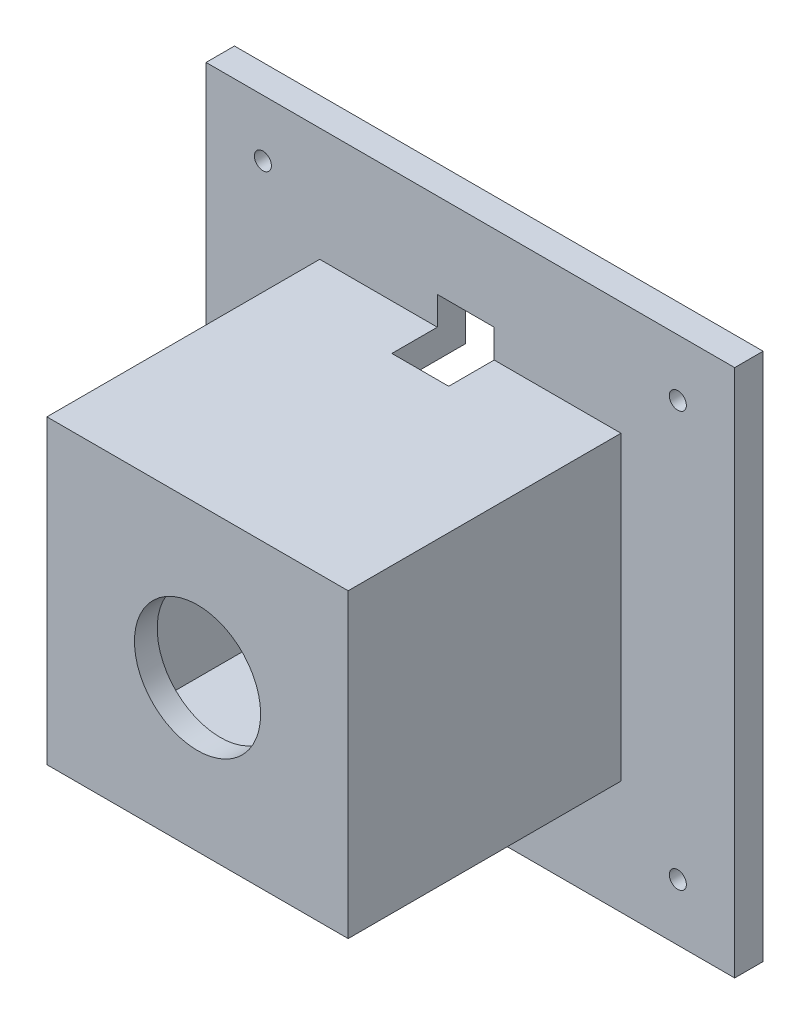
ISO-10303-21;
HEADER;
FILE_DESCRIPTION(('STEP AP214'),'2;1');
FILE_NAME('part.step','',(''),(''),'','','');
FILE_SCHEMA(('AUTOMOTIVE_DESIGN { 1 0 10303 214 1 1 1 1 }'));
ENDSEC;
DATA;
#1=APPLICATION_CONTEXT('core data for automotive mechanical design processes');
#2=APPLICATION_PROTOCOL_DEFINITION('international standard','automotive_design',2000,#1);
#3=PRODUCT_CONTEXT('',#1,'mechanical');
#4=PRODUCT('Part','Part','',(#3));
#5=PRODUCT_RELATED_PRODUCT_CATEGORY('part','',(#4));
#6=PRODUCT_DEFINITION_FORMATION('','',#4);
#7=PRODUCT_DEFINITION_CONTEXT('part definition',#1,'design');
#8=PRODUCT_DEFINITION('design','',#6,#7);
#9=PRODUCT_DEFINITION_SHAPE('','',#8);
#10=(LENGTH_UNIT() NAMED_UNIT(*) SI_UNIT(.MILLI.,.METRE.));
#11=(NAMED_UNIT(*) PLANE_ANGLE_UNIT() SI_UNIT($,.RADIAN.));
#12=(NAMED_UNIT(*) SI_UNIT($,.STERADIAN.) SOLID_ANGLE_UNIT());
#13=UNCERTAINTY_MEASURE_WITH_UNIT(LENGTH_MEASURE(1.E-05),#10,'distance_accuracy_value','');
#14=(GEOMETRIC_REPRESENTATION_CONTEXT(3) GLOBAL_UNCERTAINTY_ASSIGNED_CONTEXT((#13)) GLOBAL_UNIT_ASSIGNED_CONTEXT((#10,
#11,#12)) REPRESENTATION_CONTEXT('',''));
#15=CARTESIAN_POINT('',(0.,0.,0.));
#16=DIRECTION('',(0.,0.,1.));
#17=DIRECTION('',(1.,0.,0.));
#18=AXIS2_PLACEMENT_3D('',#15,#16,#17);
#19=CARTESIAN_POINT('',(-21.4803105371453,20.2236842105263,5.));
#20=DIRECTION('',(1.,0.,0.));
#21=DIRECTION('',(0.,1.,0.));
#22=AXIS2_PLACEMENT_3D('',#19,#20,#21);
#23=PLANE('',#22);
#24=DIRECTION('',(0.,-1.,0.));
#25=VECTOR('',#24,1.);
#26=CARTESIAN_POINT('',(-21.4803105371453,20.2236842105263,0.));
#27=LINE('',#26,#25);
#28=CARTESIAN_POINT('',(-21.4803105371453,20.2236842105263,0.));
#29=VERTEX_POINT('',#28);
#30=CARTESIAN_POINT('',(-21.4803105371453,-72.7763157894737,0.));
#31=VERTEX_POINT('',#30);
#32=EDGE_CURVE('E308',#29,#31,#27,.T.);
#33=ORIENTED_EDGE('',*,*,#32,.T.);
#34=DIRECTION('',(0.,0.,-1.));
#35=VECTOR('',#34,1.);
#36=CARTESIAN_POINT('',(-21.4803105371453,-72.7763157894737,5.));
#37=LINE('',#36,#35);
#38=CARTESIAN_POINT('',(-21.4803105371453,-72.7763157894737,5.));
#39=VERTEX_POINT('',#38);
#40=EDGE_CURVE('E11',#39,#31,#37,.T.);
#41=ORIENTED_EDGE('',*,*,#40,.F.);
#42=DIRECTION('',(0.,-1.,0.));
#43=VECTOR('',#42,1.);
#44=CARTESIAN_POINT('',(-21.4803105371453,20.2236842105263,5.));
#45=LINE('',#44,#43);
#46=CARTESIAN_POINT('',(-21.4803105371453,20.2236842105263,5.));
#47=VERTEX_POINT('',#46);
#48=EDGE_CURVE('E309',#47,#39,#45,.T.);
#49=ORIENTED_EDGE('',*,*,#48,.F.);
#50=DIRECTION('',(0.,0.,-1.));
#51=VECTOR('',#50,1.);
#52=CARTESIAN_POINT('',(-21.4803105371453,20.2236842105263,5.));
#53=LINE('',#52,#51);
#54=EDGE_CURVE('E319',#47,#29,#53,.T.);
#55=ORIENTED_EDGE('',*,*,#54,.T.);
#56=EDGE_LOOP('',(#33,#41,#49,#55));
#57=FACE_BOUND('',#56,.T.);
#58=ADVANCED_FACE('F37',(#57),#23,.F.);
#59=CARTESIAN_POINT('',(-21.4803105371453,-72.7763157894737,5.));
#60=DIRECTION('',(0.,1.,0.));
#61=DIRECTION('',(0.,0.,1.));
#62=AXIS2_PLACEMENT_3D('',#59,#60,#61);
#63=PLANE('',#62);
#64=DIRECTION('',(1.,0.,0.));
#65=VECTOR('',#64,1.);
#66=CARTESIAN_POINT('',(-21.4803105371453,-72.7763157894737,0.));
#67=LINE('',#66,#65);
#68=CARTESIAN_POINT('',(71.5196894628547,-72.7763157894737,0.));
#69=VERTEX_POINT('',#68);
#70=EDGE_CURVE('E322',#31,#69,#67,.T.);
#71=ORIENTED_EDGE('',*,*,#70,.T.);
#72=DIRECTION('',(0.,0.,-1.));
#73=VECTOR('',#72,1.);
#74=CARTESIAN_POINT('',(71.5196894628547,-72.7763157894737,5.));
#75=LINE('',#74,#73);
#76=CARTESIAN_POINT('',(71.5196894628547,-72.7763157894737,5.));
#77=VERTEX_POINT('',#76);
#78=EDGE_CURVE('E44',#77,#69,#75,.T.);
#79=ORIENTED_EDGE('',*,*,#78,.F.);
#80=DIRECTION('',(1.,0.,0.));
#81=VECTOR('',#80,1.);
#82=CARTESIAN_POINT('',(-21.4803105371453,-72.7763157894737,5.));
#83=LINE('',#82,#81);
#84=EDGE_CURVE('E312',#39,#77,#83,.T.);
#85=ORIENTED_EDGE('',*,*,#84,.F.);
#86=ORIENTED_EDGE('',*,*,#40,.T.);
#87=EDGE_LOOP('',(#71,#79,#85,#86));
#88=FACE_BOUND('',#87,.T.);
#89=ADVANCED_FACE('F350',(#88),#63,.F.);
#90=CARTESIAN_POINT('',(71.5196894628547,20.2236842105263,5.));
#91=DIRECTION('',(-1.,0.,0.));
#92=DIRECTION('',(0.,-1.,0.));
#93=AXIS2_PLACEMENT_3D('',#90,#91,#92);
#94=PLANE('',#93);
#95=DIRECTION('',(0.,1.,0.));
#96=VECTOR('',#95,1.);
#97=CARTESIAN_POINT('',(71.5196894628547,20.2236842105263,0.));
#98=LINE('',#97,#96);
#99=CARTESIAN_POINT('',(71.5196894628547,20.2236842105263,0.));
#100=VERTEX_POINT('',#99);
#101=EDGE_CURVE('E324',#69,#100,#98,.T.);
#102=ORIENTED_EDGE('',*,*,#101,.T.);
#103=DIRECTION('',(0.,0.,-1.));
#104=VECTOR('',#103,1.);
#105=CARTESIAN_POINT('',(71.5196894628547,20.2236842105263,5.));
#106=LINE('',#105,#104);
#107=CARTESIAN_POINT('',(71.5196894628547,20.2236842105263,5.));
#108=VERTEX_POINT('',#107);
#109=EDGE_CURVE('E329',#108,#100,#106,.T.);
#110=ORIENTED_EDGE('',*,*,#109,.F.);
#111=DIRECTION('',(0.,1.,0.));
#112=VECTOR('',#111,1.);
#113=CARTESIAN_POINT('',(71.5196894628547,20.2236842105263,5.));
#114=LINE('',#113,#112);
#115=EDGE_CURVE('E315',#77,#108,#114,.T.);
#116=ORIENTED_EDGE('',*,*,#115,.F.);
#117=ORIENTED_EDGE('',*,*,#78,.T.);
#118=EDGE_LOOP('',(#102,#110,#116,#117));
#119=FACE_BOUND('',#118,.T.);
#120=ADVANCED_FACE('F336',(#119),#94,.F.);
#121=CARTESIAN_POINT('',(-21.4803105371453,20.2236842105263,5.));
#122=DIRECTION('',(0.,-1.,0.));
#123=DIRECTION('',(0.,0.,-1.));
#124=AXIS2_PLACEMENT_3D('',#121,#122,#123);
#125=PLANE('',#124);
#126=DIRECTION('',(-1.,0.,0.));
#127=VECTOR('',#126,1.);
#128=CARTESIAN_POINT('',(-21.4803105371453,20.2236842105263,0.));
#129=LINE('',#128,#127);
#130=EDGE_CURVE('E313',#100,#29,#129,.T.);
#131=ORIENTED_EDGE('',*,*,#130,.T.);
#132=ORIENTED_EDGE('',*,*,#54,.F.);
#133=DIRECTION('',(-1.,0.,0.));
#134=VECTOR('',#133,1.);
#135=CARTESIAN_POINT('',(-21.4803105371453,20.2236842105263,5.));
#136=LINE('',#135,#134);
#137=EDGE_CURVE('E317',#108,#47,#136,.T.);
#138=ORIENTED_EDGE('',*,*,#137,.F.);
#139=ORIENTED_EDGE('',*,*,#109,.T.);
#140=EDGE_LOOP('',(#131,#132,#138,#139));
#141=FACE_BOUND('',#140,.T.);
#142=ADVANCED_FACE('F343',(#141),#125,.F.);
#143=CARTESIAN_POINT('',(0.,0.,5.));
#144=DIRECTION('',(0.,0.,1.));
#145=DIRECTION('',(1.,0.,0.));
#146=AXIS2_PLACEMENT_3D('',#143,#144,#145);
#147=PLANE('',#146);
#148=DIRECTION('',(0.,-1.,0.));
#149=VECTOR('',#148,1.);
#150=CARTESIAN_POINT('',(19.2073183048365,0.,5.));
#151=LINE('',#150,#149);
#152=CARTESIAN_POINT('',(19.2073183048365,5.22368421052628,5.));
#153=VERTEX_POINT('',#152);
#154=CARTESIAN_POINT('',(19.2073183048365,0.223681623808147,5.));
#155=VERTEX_POINT('',#154);
#156=EDGE_CURVE('E208',#153,#155,#151,.T.);
#157=ORIENTED_EDGE('',*,*,#156,.F.);
#158=DIRECTION('',(-1.,0.,0.));
#159=VECTOR('',#158,1.);
#160=CARTESIAN_POINT('',(0.,5.22368421052628,5.));
#161=LINE('',#160,#159);
#162=CARTESIAN_POINT('',(29.2073183048365,5.22368421052628,5.));
#163=VERTEX_POINT('',#162);
#164=EDGE_CURVE('E167',#163,#153,#161,.T.);
#165=ORIENTED_EDGE('',*,*,#164,.F.);
#166=DIRECTION('',(0.,1.,0.));
#167=VECTOR('',#166,1.);
#168=CARTESIAN_POINT('',(29.2073183048365,0.,5.));
#169=LINE('',#168,#167);
#170=CARTESIAN_POINT('',(29.2073183048365,0.223681623808147,5.));
#171=VERTEX_POINT('',#170);
#172=EDGE_CURVE('E200',#171,#163,#169,.T.);
#173=ORIENTED_EDGE('',*,*,#172,.F.);
#174=DIRECTION('',(-1.,0.,0.));
#175=VECTOR('',#174,1.);
#176=CARTESIAN_POINT('',(-1.48030795042717,0.223681623808147,5.));
#177=LINE('',#176,#175);
#178=CARTESIAN_POINT('',(51.5196920495728,0.223681623808147,5.));
#179=VERTEX_POINT('',#178);
#180=EDGE_CURVE('E279',#179,#171,#177,.T.);
#181=ORIENTED_EDGE('',*,*,#180,.F.);
#182=DIRECTION('',(0.,1.,0.));
#183=VECTOR('',#182,1.);
#184=CARTESIAN_POINT('',(51.5196920495728,0.223681623808147,5.));
#185=LINE('',#184,#183);
#186=CARTESIAN_POINT('',(51.5196920495728,-52.7763183761919,5.));
#187=VERTEX_POINT('',#186);
#188=EDGE_CURVE('E291',#187,#179,#185,.T.);
#189=ORIENTED_EDGE('',*,*,#188,.F.);
#190=DIRECTION('',(1.,0.,0.));
#191=VECTOR('',#190,1.);
#192=CARTESIAN_POINT('',(-1.48030795042717,-52.7763183761919,5.));
#193=LINE('',#192,#191);
#194=CARTESIAN_POINT('',(-1.48030795042717,-52.7763183761919,5.));
#195=VERTEX_POINT('',#194);
#196=EDGE_CURVE('E288',#195,#187,#193,.T.);
#197=ORIENTED_EDGE('',*,*,#196,.F.);
#198=DIRECTION('',(0.,-1.,0.));
#199=VECTOR('',#198,1.);
#200=CARTESIAN_POINT('',(-1.48030795042717,0.223681623808147,5.));
#201=LINE('',#200,#199);
#202=CARTESIAN_POINT('',(-1.48030795042717,0.223681623808147,5.));
#203=VERTEX_POINT('',#202);
#204=EDGE_CURVE('E267',#203,#195,#201,.T.);
#205=ORIENTED_EDGE('',*,*,#204,.F.);
#206=EDGE_CURVE('E294',#155,#203,#177,.T.);
#207=ORIENTED_EDGE('',*,*,#206,.F.);
#208=EDGE_LOOP('',(#157,#165,#173,#181,#189,#197,#205,#207));
#209=FACE_BOUND('',#208,.T.);
#210=CARTESIAN_POINT('',(61.5196894628547,10.2236842105263,5.));
#211=DIRECTION('',(0.,0.,1.));
#212=DIRECTION('',(1.,0.,0.));
#213=AXIS2_PLACEMENT_3D('',#210,#211,#212);
#214=CIRCLE('',#213,1.49999999999999);
#215=CARTESIAN_POINT('',(63.0196894628547,10.2236842105263,5.));
#216=VERTEX_POINT('',#215);
#217=EDGE_CURVE('E211',#216,#216,#214,.T.);
#218=ORIENTED_EDGE('',*,*,#217,.F.);
#219=EDGE_LOOP('',(#218));
#220=FACE_BOUND('',#219,.T.);
#221=CARTESIAN_POINT('',(-11.4803105371453,10.2236842105263,5.));
#222=DIRECTION('',(0.,0.,1.));
#223=DIRECTION('',(1.,0.,0.));
#224=AXIS2_PLACEMENT_3D('',#221,#222,#223);
#225=CIRCLE('',#224,1.5);
#226=CARTESIAN_POINT('',(-9.98031053714534,10.2236842105263,5.));
#227=VERTEX_POINT('',#226);
#228=EDGE_CURVE('E220',#227,#227,#225,.T.);
#229=ORIENTED_EDGE('',*,*,#228,.F.);
#230=EDGE_LOOP('',(#229));
#231=FACE_BOUND('',#230,.T.);
#232=CARTESIAN_POINT('',(-11.4803105371453,-62.7763157894737,5.));
#233=DIRECTION('',(0.,0.,1.));
#234=DIRECTION('',(1.,0.,0.));
#235=AXIS2_PLACEMENT_3D('',#232,#233,#234);
#236=CIRCLE('',#235,1.5);
#237=CARTESIAN_POINT('',(-9.98031053714533,-62.7763157894737,5.));
#238=VERTEX_POINT('',#237);
#239=EDGE_CURVE('E212',#238,#238,#236,.T.);
#240=ORIENTED_EDGE('',*,*,#239,.F.);
#241=EDGE_LOOP('',(#240));
#242=FACE_BOUND('',#241,.T.);
#243=CARTESIAN_POINT('',(61.5196894628547,-62.7763157894737,5.));
#244=DIRECTION('',(0.,0.,1.));
#245=DIRECTION('',(1.,0.,0.));
#246=AXIS2_PLACEMENT_3D('',#243,#244,#245);
#247=CIRCLE('',#246,1.5);
#248=CARTESIAN_POINT('',(63.0196894628547,-62.7763157894737,5.));
#249=VERTEX_POINT('',#248);
#250=EDGE_CURVE('E219',#249,#249,#247,.T.);
#251=ORIENTED_EDGE('',*,*,#250,.F.);
#252=EDGE_LOOP('',(#251));
#253=FACE_BOUND('',#252,.T.);
#254=ORIENTED_EDGE('',*,*,#48,.T.);
#255=ORIENTED_EDGE('',*,*,#84,.T.);
#256=ORIENTED_EDGE('',*,*,#115,.T.);
#257=ORIENTED_EDGE('',*,*,#137,.T.);
#258=EDGE_LOOP('',(#254,#255,#256,#257));
#259=FACE_BOUND('',#258,.T.);
#260=ADVANCED_FACE('F349',(#209,#220,#231,#242,#253,#259),#147,.T.);
#261=CARTESIAN_POINT('',(0.,0.,0.));
#262=DIRECTION('',(0.,0.,1.));
#263=DIRECTION('',(1.,0.,0.));
#264=AXIS2_PLACEMENT_3D('',#261,#262,#263);
#265=PLANE('',#264);
#266=CARTESIAN_POINT('',(61.5196894628547,10.2236842105263,0.));
#267=DIRECTION('',(0.,0.,1.));
#268=DIRECTION('',(1.,0.,0.));
#269=AXIS2_PLACEMENT_3D('',#266,#267,#268);
#270=CIRCLE('',#269,1.49999999999999);
#271=CARTESIAN_POINT('',(63.0196894628547,10.2236842105263,0.));
#272=VERTEX_POINT('',#271);
#273=EDGE_CURVE('E223',#272,#272,#270,.F.);
#274=ORIENTED_EDGE('',*,*,#273,.F.);
#275=EDGE_LOOP('',(#274));
#276=FACE_BOUND('',#275,.T.);
#277=CARTESIAN_POINT('',(-11.4803105371453,10.2236842105263,0.));
#278=DIRECTION('',(0.,0.,1.));
#279=DIRECTION('',(1.,0.,0.));
#280=AXIS2_PLACEMENT_3D('',#277,#278,#279);
#281=CIRCLE('',#280,1.5);
#282=CARTESIAN_POINT('',(-9.98031053714534,10.2236842105263,0.));
#283=VERTEX_POINT('',#282);
#284=EDGE_CURVE('E216',#283,#283,#281,.F.);
#285=ORIENTED_EDGE('',*,*,#284,.F.);
#286=EDGE_LOOP('',(#285));
#287=FACE_BOUND('',#286,.T.);
#288=CARTESIAN_POINT('',(-11.4803105371453,-62.7763157894737,0.));
#289=DIRECTION('',(0.,0.,1.));
#290=DIRECTION('',(1.,0.,0.));
#291=AXIS2_PLACEMENT_3D('',#288,#289,#290);
#292=CIRCLE('',#291,1.5);
#293=CARTESIAN_POINT('',(-9.98031053714533,-62.7763157894737,0.));
#294=VERTEX_POINT('',#293);
#295=EDGE_CURVE('E215',#294,#294,#292,.F.);
#296=ORIENTED_EDGE('',*,*,#295,.F.);
#297=EDGE_LOOP('',(#296));
#298=FACE_BOUND('',#297,.T.);
#299=CARTESIAN_POINT('',(61.5196894628547,-62.7763157894737,0.));
#300=DIRECTION('',(0.,0.,1.));
#301=DIRECTION('',(1.,0.,0.));
#302=AXIS2_PLACEMENT_3D('',#299,#300,#301);
#303=CIRCLE('',#302,1.5);
#304=CARTESIAN_POINT('',(63.0196894628547,-62.7763157894737,0.));
#305=VERTEX_POINT('',#304);
#306=EDGE_CURVE('E232',#305,#305,#303,.F.);
#307=ORIENTED_EDGE('',*,*,#306,.F.);
#308=EDGE_LOOP('',(#307));
#309=FACE_BOUND('',#308,.T.);
#310=DIRECTION('',(1.,0.,0.));
#311=VECTOR('',#310,1.);
#312=CARTESIAN_POINT('',(19.2073183048365,5.22368421052628,0.));
#313=LINE('',#312,#311);
#314=CARTESIAN_POINT('',(19.2073183048365,5.22368421052628,0.));
#315=VERTEX_POINT('',#314);
#316=CARTESIAN_POINT('',(29.2073183048365,5.22368421052628,0.));
#317=VERTEX_POINT('',#316);
#318=EDGE_CURVE('E165',#315,#317,#313,.T.);
#319=ORIENTED_EDGE('',*,*,#318,.F.);
#320=DIRECTION('',(0.,-1.,0.));
#321=VECTOR('',#320,1.);
#322=CARTESIAN_POINT('',(19.2073183048365,5.22368421052628,0.));
#323=LINE('',#322,#321);
#324=CARTESIAN_POINT('',(19.2073183048365,-4.77631578947372,0.));
#325=VERTEX_POINT('',#324);
#326=EDGE_CURVE('E173',#315,#325,#323,.T.);
#327=ORIENTED_EDGE('',*,*,#326,.T.);
#328=DIRECTION('',(1.,0.,0.));
#329=VECTOR('',#328,1.);
#330=CARTESIAN_POINT('',(46.5196894628546,-4.77631578947372,0.));
#331=LINE('',#330,#329);
#332=CARTESIAN_POINT('',(3.51968946285465,-4.77631578947372,0.));
#333=VERTEX_POINT('',#332);
#334=EDGE_CURVE('E258',#333,#325,#331,.T.);
#335=ORIENTED_EDGE('',*,*,#334,.F.);
#336=DIRECTION('',(0.,1.,0.));
#337=VECTOR('',#336,1.);
#338=CARTESIAN_POINT('',(3.51968946285465,-47.7763157894737,0.));
#339=LINE('',#338,#337);
#340=CARTESIAN_POINT('',(3.51968946285465,-47.7763157894737,0.));
#341=VERTEX_POINT('',#340);
#342=EDGE_CURVE('E241',#341,#333,#339,.T.);
#343=ORIENTED_EDGE('',*,*,#342,.F.);
#344=DIRECTION('',(-1.,0.,0.));
#345=VECTOR('',#344,1.);
#346=CARTESIAN_POINT('',(46.5196894628546,-47.7763157894737,0.));
#347=LINE('',#346,#345);
#348=CARTESIAN_POINT('',(46.5196894628546,-47.7763157894737,0.));
#349=VERTEX_POINT('',#348);
#350=EDGE_CURVE('E246',#349,#341,#347,.T.);
#351=ORIENTED_EDGE('',*,*,#350,.F.);
#352=DIRECTION('',(0.,-1.,0.));
#353=VECTOR('',#352,1.);
#354=CARTESIAN_POINT('',(46.5196894628546,-47.7763157894737,0.));
#355=LINE('',#354,#353);
#356=CARTESIAN_POINT('',(46.5196894628546,-4.77631578947372,0.));
#357=VERTEX_POINT('',#356);
#358=EDGE_CURVE('E260',#357,#349,#355,.T.);
#359=ORIENTED_EDGE('',*,*,#358,.F.);
#360=CARTESIAN_POINT('',(29.2073183048365,-4.77631578947372,0.));
#361=VERTEX_POINT('',#360);
#362=EDGE_CURVE('E257',#361,#357,#331,.T.);
#363=ORIENTED_EDGE('',*,*,#362,.F.);
#364=DIRECTION('',(0.,-1.,0.));
#365=VECTOR('',#364,1.);
#366=CARTESIAN_POINT('',(29.2073183048365,5.22368421052628,0.));
#367=LINE('',#366,#365);
#368=EDGE_CURVE('E57',#317,#361,#367,.T.);
#369=ORIENTED_EDGE('',*,*,#368,.F.);
#370=EDGE_LOOP('',(#319,#327,#335,#343,#351,#359,#363,#369));
#371=FACE_BOUND('',#370,.T.);
#372=ORIENTED_EDGE('',*,*,#32,.F.);
#373=ORIENTED_EDGE('',*,*,#130,.F.);
#374=ORIENTED_EDGE('',*,*,#101,.F.);
#375=ORIENTED_EDGE('',*,*,#70,.F.);
#376=EDGE_LOOP('',(#372,#373,#374,#375));
#377=FACE_BOUND('',#376,.T.);
#378=ADVANCED_FACE('F182',(#276,#287,#298,#309,#371,#377),#265,.F.);
#379=CARTESIAN_POINT('',(-1.48030795042717,0.223681623808147,53.));
#380=DIRECTION('',(1.,0.,0.));
#381=DIRECTION('',(0.,0.,-1.));
#382=AXIS2_PLACEMENT_3D('',#379,#380,#381);
#383=PLANE('',#382);
#384=ORIENTED_EDGE('',*,*,#204,.T.);
#385=DIRECTION('',(0.,0.,-1.));
#386=VECTOR('',#385,1.);
#387=CARTESIAN_POINT('',(-1.48030795042717,-52.7763183761919,53.));
#388=LINE('',#387,#386);
#389=CARTESIAN_POINT('',(-1.48030795042717,-52.7763183761919,53.));
#390=VERTEX_POINT('',#389);
#391=EDGE_CURVE('E305',#390,#195,#388,.T.);
#392=ORIENTED_EDGE('',*,*,#391,.F.);
#393=DIRECTION('',(0.,-1.,0.));
#394=VECTOR('',#393,1.);
#395=CARTESIAN_POINT('',(-1.48030795042717,0.223681623808147,53.));
#396=LINE('',#395,#394);
#397=CARTESIAN_POINT('',(-1.48030795042717,0.223681623808147,53.));
#398=VERTEX_POINT('',#397);
#399=EDGE_CURVE('E275',#398,#390,#396,.T.);
#400=ORIENTED_EDGE('',*,*,#399,.F.);
#401=DIRECTION('',(0.,0.,-1.));
#402=VECTOR('',#401,1.);
#403=CARTESIAN_POINT('',(-1.48030795042717,0.223681623808147,53.));
#404=LINE('',#403,#402);
#405=EDGE_CURVE('E285',#398,#203,#404,.T.);
#406=ORIENTED_EDGE('',*,*,#405,.T.);
#407=EDGE_LOOP('',(#384,#392,#400,#406));
#408=FACE_BOUND('',#407,.T.);
#409=ADVANCED_FACE('F362',(#408),#383,.F.);
#410=CARTESIAN_POINT('',(-1.48030795042717,-52.7763183761919,53.));
#411=DIRECTION('',(0.,1.,0.));
#412=DIRECTION('',(0.,0.,1.));
#413=AXIS2_PLACEMENT_3D('',#410,#411,#412);
#414=PLANE('',#413);
#415=ORIENTED_EDGE('',*,*,#196,.T.);
#416=DIRECTION('',(0.,0.,-1.));
#417=VECTOR('',#416,1.);
#418=CARTESIAN_POINT('',(51.5196920495728,-52.7763183761919,53.));
#419=LINE('',#418,#417);
#420=CARTESIAN_POINT('',(51.5196920495728,-52.7763183761919,53.));
#421=VERTEX_POINT('',#420);
#422=EDGE_CURVE('E302',#421,#187,#419,.T.);
#423=ORIENTED_EDGE('',*,*,#422,.F.);
#424=DIRECTION('',(1.,0.,0.));
#425=VECTOR('',#424,1.);
#426=CARTESIAN_POINT('',(-1.48030795042717,-52.7763183761919,53.));
#427=LINE('',#426,#425);
#428=EDGE_CURVE('E278',#390,#421,#427,.T.);
#429=ORIENTED_EDGE('',*,*,#428,.F.);
#430=ORIENTED_EDGE('',*,*,#391,.T.);
#431=EDGE_LOOP('',(#415,#423,#429,#430));
#432=FACE_BOUND('',#431,.T.);
#433=ADVANCED_FACE('F369',(#432),#414,.F.);
#434=CARTESIAN_POINT('',(51.5196920495728,0.223681623808147,53.));
#435=DIRECTION('',(-1.,0.,0.));
#436=DIRECTION('',(0.,0.,1.));
#437=AXIS2_PLACEMENT_3D('',#434,#435,#436);
#438=PLANE('',#437);
#439=ORIENTED_EDGE('',*,*,#188,.T.);
#440=DIRECTION('',(0.,0.,-1.));
#441=VECTOR('',#440,1.);
#442=CARTESIAN_POINT('',(51.5196920495728,0.223681623808147,53.));
#443=LINE('',#442,#441);
#444=CARTESIAN_POINT('',(51.5196920495728,0.223681623808147,53.));
#445=VERTEX_POINT('',#444);
#446=EDGE_CURVE('E299',#445,#179,#443,.T.);
#447=ORIENTED_EDGE('',*,*,#446,.F.);
#448=DIRECTION('',(0.,1.,0.));
#449=VECTOR('',#448,1.);
#450=CARTESIAN_POINT('',(51.5196920495728,0.223681623808147,53.));
#451=LINE('',#450,#449);
#452=EDGE_CURVE('E281',#421,#445,#451,.T.);
#453=ORIENTED_EDGE('',*,*,#452,.F.);
#454=ORIENTED_EDGE('',*,*,#422,.T.);
#455=EDGE_LOOP('',(#439,#447,#453,#454));
#456=FACE_BOUND('',#455,.T.);
#457=ADVANCED_FACE('F373',(#456),#438,.F.);
#458=CARTESIAN_POINT('',(-1.48030795042717,0.223681623808147,53.));
#459=DIRECTION('',(0.,-1.,0.));
#460=DIRECTION('',(0.,0.,-1.));
#461=AXIS2_PLACEMENT_3D('',#458,#459,#460);
#462=PLANE('',#461);
#463=DIRECTION('',(-1.,0.,0.));
#464=VECTOR('',#463,1.);
#465=CARTESIAN_POINT('',(-1.48030795042717,0.223681623808147,13.));
#466=LINE('',#465,#464);
#467=CARTESIAN_POINT('',(29.2073183048365,0.223681623808147,13.));
#468=VERTEX_POINT('',#467);
#469=CARTESIAN_POINT('',(19.2073183048365,0.223681623808147,13.));
#470=VERTEX_POINT('',#469);
#471=EDGE_CURVE('E202',#468,#470,#466,.T.);
#472=ORIENTED_EDGE('',*,*,#471,.T.);
#473=DIRECTION('',(0.,0.,-1.));
#474=VECTOR('',#473,1.);
#475=CARTESIAN_POINT('',(19.2073183048365,0.223681623808147,53.));
#476=LINE('',#475,#474);
#477=EDGE_CURVE('E205',#470,#155,#476,.T.);
#478=ORIENTED_EDGE('',*,*,#477,.T.);
#479=ORIENTED_EDGE('',*,*,#206,.T.);
#480=ORIENTED_EDGE('',*,*,#405,.F.);
#481=DIRECTION('',(-1.,0.,0.));
#482=VECTOR('',#481,1.);
#483=CARTESIAN_POINT('',(-1.48030795042717,0.223681623808147,53.));
#484=LINE('',#483,#482);
#485=EDGE_CURVE('E283',#445,#398,#484,.T.);
#486=ORIENTED_EDGE('',*,*,#485,.F.);
#487=ORIENTED_EDGE('',*,*,#446,.T.);
#488=ORIENTED_EDGE('',*,*,#180,.T.);
#489=DIRECTION('',(0.,0.,1.));
#490=VECTOR('',#489,1.);
#491=CARTESIAN_POINT('',(29.2073183048365,0.223681623808147,53.));
#492=LINE('',#491,#490);
#493=EDGE_CURVE('E195',#171,#468,#492,.T.);
#494=ORIENTED_EDGE('',*,*,#493,.T.);
#495=EDGE_LOOP('',(#472,#478,#479,#480,#486,#487,#488,#494));
#496=FACE_BOUND('',#495,.T.);
#497=ADVANCED_FACE('F377',(#496),#462,.F.);
#498=CARTESIAN_POINT('',(0.,0.,53.));
#499=DIRECTION('',(0.,0.,1.));
#500=DIRECTION('',(1.,0.,0.));
#501=AXIS2_PLACEMENT_3D('',#498,#499,#500);
#502=PLANE('',#501);
#503=CARTESIAN_POINT('',(25.0196920495728,-26.2763183761919,53.));
#504=DIRECTION('',(0.,0.,1.));
#505=DIRECTION('',(1.,0.,0.));
#506=AXIS2_PLACEMENT_3D('',#503,#504,#505);
#507=CIRCLE('',#506,11.1);
#508=CARTESIAN_POINT('',(36.1196920495728,-26.2763183761919,53.));
#509=VERTEX_POINT('',#508);
#510=EDGE_CURVE('E235',#509,#509,#507,.T.);
#511=ORIENTED_EDGE('',*,*,#510,.F.);
#512=EDGE_LOOP('',(#511));
#513=FACE_BOUND('',#512,.T.);
#514=ORIENTED_EDGE('',*,*,#399,.T.);
#515=ORIENTED_EDGE('',*,*,#428,.T.);
#516=ORIENTED_EDGE('',*,*,#452,.T.);
#517=ORIENTED_EDGE('',*,*,#485,.T.);
#518=EDGE_LOOP('',(#514,#515,#516,#517));
#519=FACE_BOUND('',#518,.T.);
#520=ADVANCED_FACE('F381',(#513,#519),#502,.T.);
#521=CARTESIAN_POINT('',(3.51968946285465,-47.7763157894737,49.));
#522=DIRECTION('',(-1.,0.,0.));
#523=DIRECTION('',(0.,0.,1.));
#524=AXIS2_PLACEMENT_3D('',#521,#522,#523);
#525=PLANE('',#524);
#526=ORIENTED_EDGE('',*,*,#342,.T.);
#527=DIRECTION('',(0.,0.,-1.));
#528=VECTOR('',#527,1.);
#529=CARTESIAN_POINT('',(3.51968946285465,-4.77631578947372,49.));
#530=LINE('',#529,#528);
#531=CARTESIAN_POINT('',(3.51968946285465,-4.77631578947372,49.));
#532=VERTEX_POINT('',#531);
#533=EDGE_CURVE('E255',#532,#333,#530,.T.);
#534=ORIENTED_EDGE('',*,*,#533,.F.);
#535=DIRECTION('',(0.,1.,0.));
#536=VECTOR('',#535,1.);
#537=CARTESIAN_POINT('',(3.51968946285465,-47.7763157894737,49.));
#538=LINE('',#537,#536);
#539=CARTESIAN_POINT('',(3.51968946285465,-47.7763157894737,49.));
#540=VERTEX_POINT('',#539);
#541=EDGE_CURVE('E242',#540,#532,#538,.T.);
#542=ORIENTED_EDGE('',*,*,#541,.F.);
#543=DIRECTION('',(0.,0.,-1.));
#544=VECTOR('',#543,1.);
#545=CARTESIAN_POINT('',(3.51968946285465,-47.7763157894737,49.));
#546=LINE('',#545,#544);
#547=EDGE_CURVE('E265',#540,#341,#546,.T.);
#548=ORIENTED_EDGE('',*,*,#547,.T.);
#549=EDGE_LOOP('',(#526,#534,#542,#548));
#550=FACE_BOUND('',#549,.T.);
#551=ADVANCED_FACE('F385',(#550),#525,.F.);
#552=CARTESIAN_POINT('',(46.5196894628546,-47.7763157894737,49.));
#553=DIRECTION('',(0.,-1.,0.));
#554=DIRECTION('',(0.,0.,-1.));
#555=AXIS2_PLACEMENT_3D('',#552,#553,#554);
#556=PLANE('',#555);
#557=ORIENTED_EDGE('',*,*,#350,.T.);
#558=ORIENTED_EDGE('',*,*,#547,.F.);
#559=DIRECTION('',(-1.,0.,0.));
#560=VECTOR('',#559,1.);
#561=CARTESIAN_POINT('',(46.5196894628546,-47.7763157894737,49.));
#562=LINE('',#561,#560);
#563=CARTESIAN_POINT('',(46.5196894628546,-47.7763157894737,49.));
#564=VERTEX_POINT('',#563);
#565=EDGE_CURVE('E252',#564,#540,#562,.T.);
#566=ORIENTED_EDGE('',*,*,#565,.F.);
#567=DIRECTION('',(0.,0.,-1.));
#568=VECTOR('',#567,1.);
#569=CARTESIAN_POINT('',(46.5196894628546,-47.7763157894737,49.));
#570=LINE('',#569,#568);
#571=EDGE_CURVE('E268',#564,#349,#570,.T.);
#572=ORIENTED_EDGE('',*,*,#571,.T.);
#573=EDGE_LOOP('',(#557,#558,#566,#572));
#574=FACE_BOUND('',#573,.T.);
#575=ADVANCED_FACE('F389',(#574),#556,.F.);
#576=CARTESIAN_POINT('',(46.5196894628546,-47.7763157894737,49.));
#577=DIRECTION('',(1.,0.,0.));
#578=DIRECTION('',(0.,0.,-1.));
#579=AXIS2_PLACEMENT_3D('',#576,#577,#578);
#580=PLANE('',#579);
#581=ORIENTED_EDGE('',*,*,#358,.T.);
#582=ORIENTED_EDGE('',*,*,#571,.F.);
#583=DIRECTION('',(0.,-1.,0.));
#584=VECTOR('',#583,1.);
#585=CARTESIAN_POINT('',(46.5196894628546,-47.7763157894737,49.));
#586=LINE('',#585,#584);
#587=CARTESIAN_POINT('',(46.5196894628546,-4.77631578947372,49.));
#588=VERTEX_POINT('',#587);
#589=EDGE_CURVE('E249',#588,#564,#586,.T.);
#590=ORIENTED_EDGE('',*,*,#589,.F.);
#591=DIRECTION('',(0.,0.,-1.));
#592=VECTOR('',#591,1.);
#593=CARTESIAN_POINT('',(46.5196894628546,-4.77631578947372,49.));
#594=LINE('',#593,#592);
#595=EDGE_CURVE('E270',#588,#357,#594,.T.);
#596=ORIENTED_EDGE('',*,*,#595,.T.);
#597=EDGE_LOOP('',(#581,#582,#590,#596));
#598=FACE_BOUND('',#597,.T.);
#599=ADVANCED_FACE('F395',(#598),#580,.F.);
#600=CARTESIAN_POINT('',(46.5196894628546,-4.77631578947372,49.));
#601=DIRECTION('',(0.,1.,0.));
#602=DIRECTION('',(0.,0.,1.));
#603=AXIS2_PLACEMENT_3D('',#600,#601,#602);
#604=PLANE('',#603);
#605=ORIENTED_EDGE('',*,*,#334,.T.);
#606=DIRECTION('',(0.,0.,-1.));
#607=VECTOR('',#606,1.);
#608=CARTESIAN_POINT('',(19.2073183048365,-4.77631578947372,0.));
#609=LINE('',#608,#607);
#610=CARTESIAN_POINT('',(19.2073183048365,-4.77631578947372,13.));
#611=VERTEX_POINT('',#610);
#612=EDGE_CURVE('E176',#611,#325,#609,.T.);
#613=ORIENTED_EDGE('',*,*,#612,.F.);
#614=DIRECTION('',(-1.,0.,0.));
#615=VECTOR('',#614,1.);
#616=CARTESIAN_POINT('',(19.2073183048365,-4.77631578947372,13.));
#617=LINE('',#616,#615);
#618=CARTESIAN_POINT('',(29.2073183048365,-4.77631578947372,13.));
#619=VERTEX_POINT('',#618);
#620=EDGE_CURVE('E170',#619,#611,#617,.T.);
#621=ORIENTED_EDGE('',*,*,#620,.F.);
#622=DIRECTION('',(0.,0.,1.));
#623=VECTOR('',#622,1.);
#624=CARTESIAN_POINT('',(29.2073183048365,-4.77631578947372,0.));
#625=LINE('',#624,#623);
#626=EDGE_CURVE('E189',#361,#619,#625,.T.);
#627=ORIENTED_EDGE('',*,*,#626,.F.);
#628=ORIENTED_EDGE('',*,*,#362,.T.);
#629=ORIENTED_EDGE('',*,*,#595,.F.);
#630=DIRECTION('',(1.,0.,0.));
#631=VECTOR('',#630,1.);
#632=CARTESIAN_POINT('',(46.5196894628546,-4.77631578947372,49.));
#633=LINE('',#632,#631);
#634=EDGE_CURVE('E245',#532,#588,#633,.T.);
#635=ORIENTED_EDGE('',*,*,#634,.F.);
#636=ORIENTED_EDGE('',*,*,#533,.T.);
#637=EDGE_LOOP('',(#605,#613,#621,#627,#628,#629,#635,#636));
#638=FACE_BOUND('',#637,.T.);
#639=ADVANCED_FACE('F391',(#638),#604,.F.);
#640=CARTESIAN_POINT('',(0.,0.,49.));
#641=DIRECTION('',(0.,0.,1.));
#642=DIRECTION('',(1.,0.,0.));
#643=AXIS2_PLACEMENT_3D('',#640,#641,#642);
#644=PLANE('',#643);
#645=CARTESIAN_POINT('',(25.0196920495728,-26.2763183761919,49.));
#646=DIRECTION('',(0.,0.,1.));
#647=DIRECTION('',(1.,0.,0.));
#648=AXIS2_PLACEMENT_3D('',#645,#646,#647);
#649=CIRCLE('',#648,11.1);
#650=CARTESIAN_POINT('',(36.1196920495728,-26.2763183761919,49.));
#651=VERTEX_POINT('',#650);
#652=EDGE_CURVE('E238',#651,#651,#649,.F.);
#653=ORIENTED_EDGE('',*,*,#652,.F.);
#654=EDGE_LOOP('',(#653));
#655=FACE_BOUND('',#654,.T.);
#656=ORIENTED_EDGE('',*,*,#541,.T.);
#657=ORIENTED_EDGE('',*,*,#634,.T.);
#658=ORIENTED_EDGE('',*,*,#589,.T.);
#659=ORIENTED_EDGE('',*,*,#565,.T.);
#660=EDGE_LOOP('',(#656,#657,#658,#659));
#661=FACE_BOUND('',#660,.T.);
#662=ADVANCED_FACE('F394',(#655,#661),#644,.F.);
#663=CARTESIAN_POINT('',(25.0196920495728,-26.2763183761919,-0.001000000000001));
#664=DIRECTION('',(0.,0.,1.));
#665=DIRECTION('',(1.,0.,0.));
#666=AXIS2_PLACEMENT_3D('',#663,#664,#665);
#667=CYLINDRICAL_SURFACE('',#666,11.1);
#668=ORIENTED_EDGE('',*,*,#510,.T.);
#669=EDGE_LOOP('',(#668));
#670=FACE_BOUND('',#669,.T.);
#671=ORIENTED_EDGE('',*,*,#652,.T.);
#672=EDGE_LOOP('',(#671));
#673=FACE_BOUND('',#672,.T.);
#674=ADVANCED_FACE('F405',(#670,#673),#667,.F.);
#675=CARTESIAN_POINT('',(61.5196894628547,-62.7763157894737,-0.00100000000000013));
#676=DIRECTION('',(0.,0.,1.));
#677=DIRECTION('',(1.,0.,0.));
#678=AXIS2_PLACEMENT_3D('',#675,#676,#677);
#679=CYLINDRICAL_SURFACE('',#678,1.5);
#680=ORIENTED_EDGE('',*,*,#250,.T.);
#681=EDGE_LOOP('',(#680));
#682=FACE_BOUND('',#681,.T.);
#683=ORIENTED_EDGE('',*,*,#306,.T.);
#684=EDGE_LOOP('',(#683));
#685=FACE_BOUND('',#684,.T.);
#686=ADVANCED_FACE('F409',(#682,#685),#679,.F.);
#687=CARTESIAN_POINT('',(-11.4803105371453,-62.7763157894737,-0.00100000000000013));
#688=DIRECTION('',(0.,0.,1.));
#689=DIRECTION('',(1.,0.,0.));
#690=AXIS2_PLACEMENT_3D('',#687,#688,#689);
#691=CYLINDRICAL_SURFACE('',#690,1.5);
#692=ORIENTED_EDGE('',*,*,#239,.T.);
#693=EDGE_LOOP('',(#692));
#694=FACE_BOUND('',#693,.T.);
#695=ORIENTED_EDGE('',*,*,#295,.T.);
#696=EDGE_LOOP('',(#695));
#697=FACE_BOUND('',#696,.T.);
#698=ADVANCED_FACE('F413',(#694,#697),#691,.F.);
#699=CARTESIAN_POINT('',(-11.4803105371453,10.2236842105263,-0.00100000000000013));
#700=DIRECTION('',(0.,0.,1.));
#701=DIRECTION('',(1.,0.,0.));
#702=AXIS2_PLACEMENT_3D('',#699,#700,#701);
#703=CYLINDRICAL_SURFACE('',#702,1.5);
#704=ORIENTED_EDGE('',*,*,#228,.T.);
#705=EDGE_LOOP('',(#704));
#706=FACE_BOUND('',#705,.T.);
#707=ORIENTED_EDGE('',*,*,#284,.T.);
#708=EDGE_LOOP('',(#707));
#709=FACE_BOUND('',#708,.T.);
#710=ADVANCED_FACE('F419',(#706,#709),#703,.F.);
#711=CARTESIAN_POINT('',(61.5196894628547,10.2236842105263,-0.00100000000000013));
#712=DIRECTION('',(0.,0.,1.));
#713=DIRECTION('',(1.,0.,0.));
#714=AXIS2_PLACEMENT_3D('',#711,#712,#713);
#715=CYLINDRICAL_SURFACE('',#714,1.49999999999999);
#716=ORIENTED_EDGE('',*,*,#217,.T.);
#717=EDGE_LOOP('',(#716));
#718=FACE_BOUND('',#717,.T.);
#719=ORIENTED_EDGE('',*,*,#273,.T.);
#720=EDGE_LOOP('',(#719));
#721=FACE_BOUND('',#720,.T.);
#722=ADVANCED_FACE('F415',(#718,#721),#715,.F.);
#723=CARTESIAN_POINT('',(19.2073183048365,5.22368421052628,13.));
#724=DIRECTION('',(0.,0.,1.));
#725=DIRECTION('',(1.,0.,0.));
#726=AXIS2_PLACEMENT_3D('',#723,#724,#725);
#727=PLANE('',#726);
#728=DIRECTION('',(0.,-1.,0.));
#729=VECTOR('',#728,1.);
#730=CARTESIAN_POINT('',(29.2073183048365,5.22368421052628,13.));
#731=LINE('',#730,#729);
#732=EDGE_CURVE('E51',#468,#619,#731,.T.);
#733=ORIENTED_EDGE('',*,*,#732,.T.);
#734=ORIENTED_EDGE('',*,*,#620,.T.);
#735=DIRECTION('',(0.,-1.,0.));
#736=VECTOR('',#735,1.);
#737=CARTESIAN_POINT('',(19.2073183048365,5.22368421052628,13.));
#738=LINE('',#737,#736);
#739=EDGE_CURVE('E193',#470,#611,#738,.T.);
#740=ORIENTED_EDGE('',*,*,#739,.F.);
#741=ORIENTED_EDGE('',*,*,#471,.F.);
#742=EDGE_LOOP('',(#733,#734,#740,#741));
#743=FACE_BOUND('',#742,.T.);
#744=ADVANCED_FACE('F418',(#743),#727,.F.);
#745=CARTESIAN_POINT('',(19.2073183048365,5.22368421052628,0.));
#746=DIRECTION('',(-1.,0.,0.));
#747=DIRECTION('',(0.,0.,1.));
#748=AXIS2_PLACEMENT_3D('',#745,#746,#747);
#749=PLANE('',#748);
#750=ORIENTED_EDGE('',*,*,#156,.T.);
#751=ORIENTED_EDGE('',*,*,#477,.F.);
#752=ORIENTED_EDGE('',*,*,#739,.T.);
#753=ORIENTED_EDGE('',*,*,#612,.T.);
#754=ORIENTED_EDGE('',*,*,#326,.F.);
#755=DIRECTION('',(0.,0.,-1.));
#756=VECTOR('',#755,1.);
#757=CARTESIAN_POINT('',(19.2073183048365,5.22368421052628,0.));
#758=LINE('',#757,#756);
#759=EDGE_CURVE('E160',#153,#315,#758,.T.);
#760=ORIENTED_EDGE('',*,*,#759,.F.);
#761=EDGE_LOOP('',(#750,#751,#752,#753,#754,#760));
#762=FACE_BOUND('',#761,.T.);
#763=ADVANCED_FACE('F174',(#762),#749,.F.);
#764=CARTESIAN_POINT('',(29.2073183048365,5.22368421052628,0.));
#765=DIRECTION('',(1.,0.,0.));
#766=DIRECTION('',(0.,0.,-1.));
#767=AXIS2_PLACEMENT_3D('',#764,#765,#766);
#768=PLANE('',#767);
#769=ORIENTED_EDGE('',*,*,#172,.T.);
#770=DIRECTION('',(0.,0.,1.));
#771=VECTOR('',#770,1.);
#772=CARTESIAN_POINT('',(29.2073183048365,5.22368421052628,0.));
#773=LINE('',#772,#771);
#774=EDGE_CURVE('E180',#317,#163,#773,.T.);
#775=ORIENTED_EDGE('',*,*,#774,.F.);
#776=ORIENTED_EDGE('',*,*,#368,.T.);
#777=ORIENTED_EDGE('',*,*,#626,.T.);
#778=ORIENTED_EDGE('',*,*,#732,.F.);
#779=ORIENTED_EDGE('',*,*,#493,.F.);
#780=EDGE_LOOP('',(#769,#775,#776,#777,#778,#779));
#781=FACE_BOUND('',#780,.T.);
#782=ADVANCED_FACE('F429',(#781),#768,.F.);
#783=CARTESIAN_POINT('',(0.,5.22368421052628,0.));
#784=DIRECTION('',(0.,1.,0.));
#785=DIRECTION('',(0.,0.,1.));
#786=AXIS2_PLACEMENT_3D('',#783,#784,#785);
#787=PLANE('',#786);
#788=ORIENTED_EDGE('',*,*,#164,.T.);
#789=ORIENTED_EDGE('',*,*,#759,.T.);
#790=ORIENTED_EDGE('',*,*,#318,.T.);
#791=ORIENTED_EDGE('',*,*,#774,.T.);
#792=EDGE_LOOP('',(#788,#789,#790,#791));
#793=FACE_BOUND('',#792,.T.);
#794=ADVANCED_FACE('F162',(#793),#787,.F.);
#795=CLOSED_SHELL('',(#58,#89,#120,#142,#260,#378,#409,#433,#457,#497,#520,#551,#575,#599,#639,
#662,#674,#686,#698,#710,#722,#744,#763,#782,#794));
#796=MANIFOLD_SOLID_BREP('B2',#795);
#797=ADVANCED_BREP_SHAPE_REPRESENTATION('',(#18,#796),#14);
#798=SHAPE_DEFINITION_REPRESENTATION(#9,#797);
ENDSEC;
END-ISO-10303-21;
